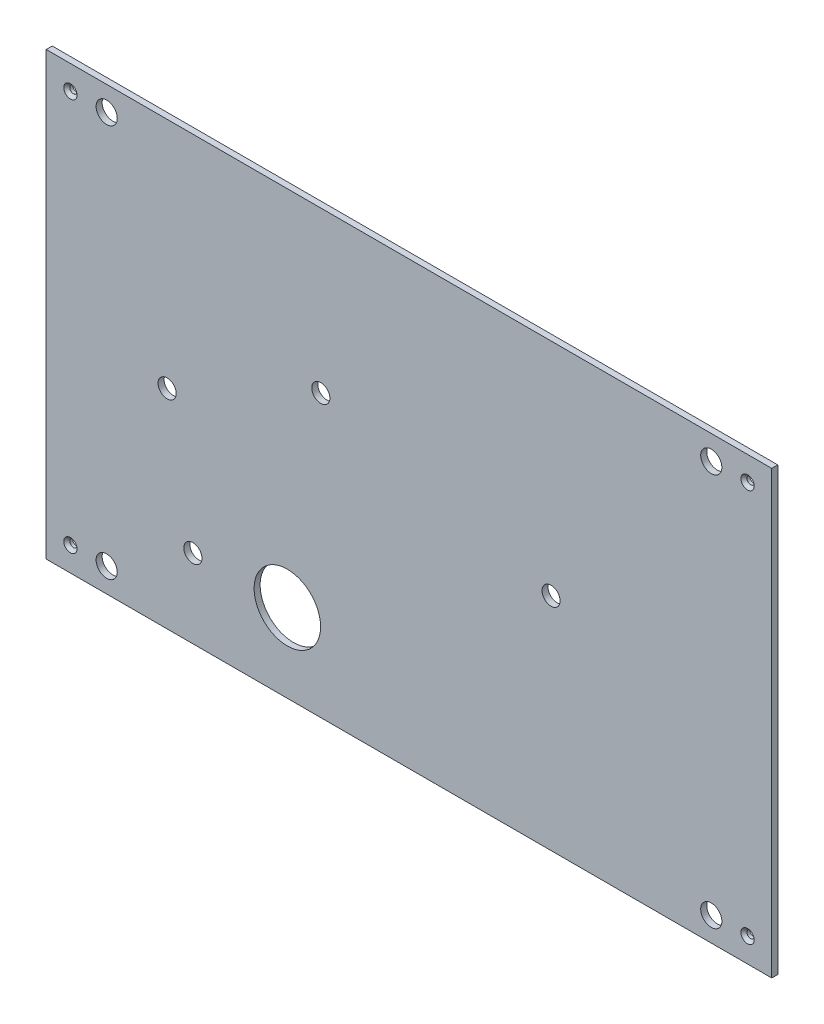
ISO-10303-21;
HEADER;
FILE_DESCRIPTION(('STEP AP214'),'2;1');
FILE_NAME('part.step','',(''),(''),'','','');
FILE_SCHEMA(('AUTOMOTIVE_DESIGN { 1 0 10303 214 1 1 1 1 }'));
ENDSEC;
DATA;
#1=APPLICATION_CONTEXT('core data for automotive mechanical design processes');
#2=APPLICATION_PROTOCOL_DEFINITION('international standard','automotive_design',2000,#1);
#3=PRODUCT_CONTEXT('',#1,'mechanical');
#4=PRODUCT('Part','Part','',(#3));
#5=PRODUCT_RELATED_PRODUCT_CATEGORY('part','',(#4));
#6=PRODUCT_DEFINITION_FORMATION('','',#4);
#7=PRODUCT_DEFINITION_CONTEXT('part definition',#1,'design');
#8=PRODUCT_DEFINITION('design','',#6,#7);
#9=PRODUCT_DEFINITION_SHAPE('','',#8);
#10=(LENGTH_UNIT() NAMED_UNIT(*) SI_UNIT(.MILLI.,.METRE.));
#11=(NAMED_UNIT(*) PLANE_ANGLE_UNIT() SI_UNIT($,.RADIAN.));
#12=(NAMED_UNIT(*) SI_UNIT($,.STERADIAN.) SOLID_ANGLE_UNIT());
#13=UNCERTAINTY_MEASURE_WITH_UNIT(LENGTH_MEASURE(1.E-05),#10,'distance_accuracy_value','');
#14=(GEOMETRIC_REPRESENTATION_CONTEXT(3) GLOBAL_UNCERTAINTY_ASSIGNED_CONTEXT((#13)) GLOBAL_UNIT_ASSIGNED_CONTEXT((#10,
#11,#12)) REPRESENTATION_CONTEXT('',''));
#15=CARTESIAN_POINT('',(0.,0.,0.));
#16=DIRECTION('',(0.,0.,1.));
#17=DIRECTION('',(1.,0.,0.));
#18=AXIS2_PLACEMENT_3D('',#15,#16,#17);
#19=CARTESIAN_POINT('',(0.,0.,2.));
#20=DIRECTION('',(0.,1.,0.));
#21=DIRECTION('',(0.,0.,1.));
#22=AXIS2_PLACEMENT_3D('',#19,#20,#21);
#23=PLANE('',#22);
#24=DIRECTION('',(1.,0.,0.));
#25=VECTOR('',#24,1.);
#26=CARTESIAN_POINT('',(0.,0.,0.));
#27=LINE('',#26,#25);
#28=CARTESIAN_POINT('',(0.,0.,0.));
#29=VERTEX_POINT('',#28);
#30=CARTESIAN_POINT('',(240.,0.,0.));
#31=VERTEX_POINT('',#30);
#32=EDGE_CURVE('E150',#29,#31,#27,.T.);
#33=ORIENTED_EDGE('',*,*,#32,.T.);
#34=DIRECTION('',(0.,0.,-1.));
#35=VECTOR('',#34,1.);
#36=CARTESIAN_POINT('',(240.,0.,2.));
#37=LINE('',#36,#35);
#38=CARTESIAN_POINT('',(240.,0.,2.));
#39=VERTEX_POINT('',#38);
#40=EDGE_CURVE('E11',#39,#31,#37,.T.);
#41=ORIENTED_EDGE('',*,*,#40,.F.);
#42=DIRECTION('',(1.,0.,0.));
#43=VECTOR('',#42,1.);
#44=CARTESIAN_POINT('',(0.,0.,2.));
#45=LINE('',#44,#43);
#46=CARTESIAN_POINT('',(0.,0.,2.));
#47=VERTEX_POINT('',#46);
#48=EDGE_CURVE('E95',#47,#39,#45,.T.);
#49=ORIENTED_EDGE('',*,*,#48,.F.);
#50=DIRECTION('',(0.,0.,-1.));
#51=VECTOR('',#50,1.);
#52=CARTESIAN_POINT('',(0.,0.,2.));
#53=LINE('',#52,#51);
#54=EDGE_CURVE('E61',#47,#29,#53,.T.);
#55=ORIENTED_EDGE('',*,*,#54,.T.);
#56=EDGE_LOOP('',(#33,#41,#49,#55));
#57=FACE_BOUND('',#56,.T.);
#58=ADVANCED_FACE('F43',(#57),#23,.F.);
#59=CARTESIAN_POINT('',(240.,0.,2.));
#60=DIRECTION('',(-1.,0.,0.));
#61=DIRECTION('',(0.,0.,1.));
#62=AXIS2_PLACEMENT_3D('',#59,#60,#61);
#63=PLANE('',#62);
#64=DIRECTION('',(0.,1.,0.));
#65=VECTOR('',#64,1.);
#66=CARTESIAN_POINT('',(240.,0.,0.));
#67=LINE('',#66,#65);
#68=CARTESIAN_POINT('',(240.,146.,0.));
#69=VERTEX_POINT('',#68);
#70=EDGE_CURVE('E101',#31,#69,#67,.T.);
#71=ORIENTED_EDGE('',*,*,#70,.T.);
#72=DIRECTION('',(0.,0.,-1.));
#73=VECTOR('',#72,1.);
#74=CARTESIAN_POINT('',(240.,146.,2.));
#75=LINE('',#74,#73);
#76=CARTESIAN_POINT('',(240.,146.,2.));
#77=VERTEX_POINT('',#76);
#78=EDGE_CURVE('E53',#77,#69,#75,.T.);
#79=ORIENTED_EDGE('',*,*,#78,.F.);
#80=DIRECTION('',(0.,1.,0.));
#81=VECTOR('',#80,1.);
#82=CARTESIAN_POINT('',(240.,0.,2.));
#83=LINE('',#82,#81);
#84=EDGE_CURVE('E86',#39,#77,#83,.T.);
#85=ORIENTED_EDGE('',*,*,#84,.F.);
#86=ORIENTED_EDGE('',*,*,#40,.T.);
#87=EDGE_LOOP('',(#71,#79,#85,#86));
#88=FACE_BOUND('',#87,.T.);
#89=ADVANCED_FACE('F100',(#88),#63,.F.);
#90=CARTESIAN_POINT('',(0.,146.,2.));
#91=DIRECTION('',(0.,1.,0.));
#92=DIRECTION('',(0.,0.,1.));
#93=AXIS2_PLACEMENT_3D('',#90,#91,#92);
#94=PLANE('',#93);
#95=DIRECTION('',(1.,0.,0.));
#96=VECTOR('',#95,1.);
#97=CARTESIAN_POINT('',(0.,146.,0.));
#98=LINE('',#97,#96);
#99=CARTESIAN_POINT('',(0.,146.,0.));
#100=VERTEX_POINT('',#99);
#101=EDGE_CURVE('E155',#100,#69,#98,.T.);
#102=ORIENTED_EDGE('',*,*,#101,.F.);
#103=DIRECTION('',(0.,0.,-1.));
#104=VECTOR('',#103,1.);
#105=CARTESIAN_POINT('',(0.,146.,2.));
#106=LINE('',#105,#104);
#107=CARTESIAN_POINT('',(0.,146.,2.));
#108=VERTEX_POINT('',#107);
#109=EDGE_CURVE('E75',#108,#100,#106,.T.);
#110=ORIENTED_EDGE('',*,*,#109,.F.);
#111=DIRECTION('',(1.,0.,0.));
#112=VECTOR('',#111,1.);
#113=CARTESIAN_POINT('',(0.,146.,2.));
#114=LINE('',#113,#112);
#115=EDGE_CURVE('E94',#108,#77,#114,.T.);
#116=ORIENTED_EDGE('',*,*,#115,.T.);
#117=ORIENTED_EDGE('',*,*,#78,.T.);
#118=EDGE_LOOP('',(#102,#110,#116,#117));
#119=FACE_BOUND('',#118,.T.);
#120=ADVANCED_FACE('F105',(#119),#94,.T.);
#121=CARTESIAN_POINT('',(220.,8.00000000000001,2.));
#122=DIRECTION('',(0.,0.,-1.));
#123=DIRECTION('',(-1.,0.,0.));
#124=AXIS2_PLACEMENT_3D('',#121,#122,#123);
#125=CYLINDRICAL_SURFACE('',#124,3.49999999999999);
#126=CARTESIAN_POINT('',(220.,8.00000000000001,2.));
#127=DIRECTION('',(0.,0.,1.));
#128=DIRECTION('',(1.,0.,0.));
#129=AXIS2_PLACEMENT_3D('',#126,#127,#128);
#130=CIRCLE('',#129,3.49999999999999);
#131=CARTESIAN_POINT('',(223.5,8.00000000000001,2.));
#132=VERTEX_POINT('',#131);
#133=EDGE_CURVE('E110',#132,#132,#130,.T.);
#134=ORIENTED_EDGE('',*,*,#133,.T.);
#135=EDGE_LOOP('',(#134));
#136=FACE_BOUND('',#135,.T.);
#137=CARTESIAN_POINT('',(220.,8.00000000000001,0.));
#138=DIRECTION('',(0.,0.,1.));
#139=DIRECTION('',(1.,0.,0.));
#140=AXIS2_PLACEMENT_3D('',#137,#138,#139);
#141=CIRCLE('',#140,3.49999999999999);
#142=CARTESIAN_POINT('',(223.5,8.00000000000001,0.));
#143=VERTEX_POINT('',#142);
#144=EDGE_CURVE('E162',#143,#143,#141,.T.);
#145=ORIENTED_EDGE('',*,*,#144,.F.);
#146=EDGE_LOOP('',(#145));
#147=FACE_BOUND('',#146,.T.);
#148=ADVANCED_FACE('F282',(#136,#147),#125,.F.);
#149=CARTESIAN_POINT('',(0.,0.,2.));
#150=DIRECTION('',(-1.,0.,0.));
#151=DIRECTION('',(0.,0.,1.));
#152=AXIS2_PLACEMENT_3D('',#149,#150,#151);
#153=PLANE('',#152);
#154=DIRECTION('',(0.,1.,0.));
#155=VECTOR('',#154,1.);
#156=CARTESIAN_POINT('',(0.,0.,0.));
#157=LINE('',#156,#155);
#158=EDGE_CURVE('E158',#29,#100,#157,.T.);
#159=ORIENTED_EDGE('',*,*,#158,.F.);
#160=ORIENTED_EDGE('',*,*,#54,.F.);
#161=DIRECTION('',(0.,1.,0.));
#162=VECTOR('',#161,1.);
#163=CARTESIAN_POINT('',(0.,0.,2.));
#164=LINE('',#163,#162);
#165=EDGE_CURVE('E107',#47,#108,#164,.T.);
#166=ORIENTED_EDGE('',*,*,#165,.T.);
#167=ORIENTED_EDGE('',*,*,#109,.T.);
#168=EDGE_LOOP('',(#159,#160,#166,#167));
#169=FACE_BOUND('',#168,.T.);
#170=ADVANCED_FACE('F241',(#169),#153,.T.);
#171=CARTESIAN_POINT('',(79.7653507489251,26.,2.));
#172=DIRECTION('',(0.,0.,-1.));
#173=DIRECTION('',(-1.,0.,0.));
#174=AXIS2_PLACEMENT_3D('',#171,#172,#173);
#175=CYLINDRICAL_SURFACE('',#174,11.);
#176=CARTESIAN_POINT('',(79.7653507489251,26.,2.));
#177=DIRECTION('',(0.,0.,1.));
#178=DIRECTION('',(1.,0.,0.));
#179=AXIS2_PLACEMENT_3D('',#176,#177,#178);
#180=CIRCLE('',#179,11.);
#181=CARTESIAN_POINT('',(90.7653507489251,26.,2.));
#182=VERTEX_POINT('',#181);
#183=EDGE_CURVE('E204',#182,#182,#180,.T.);
#184=ORIENTED_EDGE('',*,*,#183,.T.);
#185=EDGE_LOOP('',(#184));
#186=FACE_BOUND('',#185,.T.);
#187=CARTESIAN_POINT('',(79.7653507489251,26.,0.));
#188=DIRECTION('',(0.,0.,1.));
#189=DIRECTION('',(1.,0.,0.));
#190=AXIS2_PLACEMENT_3D('',#187,#188,#189);
#191=CIRCLE('',#190,11.);
#192=CARTESIAN_POINT('',(90.7653507489251,26.,0.));
#193=VERTEX_POINT('',#192);
#194=EDGE_CURVE('E146',#193,#193,#191,.T.);
#195=ORIENTED_EDGE('',*,*,#194,.F.);
#196=EDGE_LOOP('',(#195));
#197=FACE_BOUND('',#196,.T.);
#198=ADVANCED_FACE('F210',(#186,#197),#175,.F.);
#199=CARTESIAN_POINT('',(48.5153507489251,26.,2.));
#200=DIRECTION('',(0.,0.,-1.));
#201=DIRECTION('',(-1.,0.,0.));
#202=AXIS2_PLACEMENT_3D('',#199,#200,#201);
#203=CYLINDRICAL_SURFACE('',#202,3.);
#204=CARTESIAN_POINT('',(48.5153507489251,26.,2.));
#205=DIRECTION('',(0.,0.,1.));
#206=DIRECTION('',(1.,0.,0.));
#207=AXIS2_PLACEMENT_3D('',#204,#205,#206);
#208=CIRCLE('',#207,3.);
#209=CARTESIAN_POINT('',(51.5153507489251,26.,2.));
#210=VERTEX_POINT('',#209);
#211=EDGE_CURVE('E200',#210,#210,#208,.T.);
#212=ORIENTED_EDGE('',*,*,#211,.T.);
#213=EDGE_LOOP('',(#212));
#214=FACE_BOUND('',#213,.T.);
#215=CARTESIAN_POINT('',(48.5153507489251,26.,0.));
#216=DIRECTION('',(0.,0.,1.));
#217=DIRECTION('',(1.,0.,0.));
#218=AXIS2_PLACEMENT_3D('',#215,#216,#217);
#219=CIRCLE('',#218,3.);
#220=CARTESIAN_POINT('',(51.5153507489251,26.,0.));
#221=VERTEX_POINT('',#220);
#222=EDGE_CURVE('E142',#221,#221,#219,.T.);
#223=ORIENTED_EDGE('',*,*,#222,.F.);
#224=EDGE_LOOP('',(#223));
#225=FACE_BOUND('',#224,.T.);
#226=ADVANCED_FACE('F240',(#214,#225),#203,.F.);
#227=CARTESIAN_POINT('',(167.,73.,2.));
#228=DIRECTION('',(0.,0.,-1.));
#229=DIRECTION('',(-1.,0.,0.));
#230=AXIS2_PLACEMENT_3D('',#227,#228,#229);
#231=CYLINDRICAL_SURFACE('',#230,2.99999999999999);
#232=CARTESIAN_POINT('',(167.,73.,2.));
#233=DIRECTION('',(0.,0.,1.));
#234=DIRECTION('',(1.,0.,0.));
#235=AXIS2_PLACEMENT_3D('',#232,#233,#234);
#236=CIRCLE('',#235,2.99999999999999);
#237=CARTESIAN_POINT('',(170.,73.,2.));
#238=VERTEX_POINT('',#237);
#239=EDGE_CURVE('E196',#238,#238,#236,.T.);
#240=ORIENTED_EDGE('',*,*,#239,.T.);
#241=EDGE_LOOP('',(#240));
#242=FACE_BOUND('',#241,.T.);
#243=CARTESIAN_POINT('',(167.,73.,0.));
#244=DIRECTION('',(0.,0.,1.));
#245=DIRECTION('',(1.,0.,0.));
#246=AXIS2_PLACEMENT_3D('',#243,#244,#245);
#247=CIRCLE('',#246,2.99999999999999);
#248=CARTESIAN_POINT('',(170.,73.,0.));
#249=VERTEX_POINT('',#248);
#250=EDGE_CURVE('E138',#249,#249,#247,.T.);
#251=ORIENTED_EDGE('',*,*,#250,.F.);
#252=EDGE_LOOP('',(#251));
#253=FACE_BOUND('',#252,.T.);
#254=ADVANCED_FACE('F244',(#242,#253),#231,.F.);
#255=CARTESIAN_POINT('',(90.8320113170894,93.,2.));
#256=DIRECTION('',(0.,0.,-1.));
#257=DIRECTION('',(-1.,0.,0.));
#258=AXIS2_PLACEMENT_3D('',#255,#256,#257);
#259=CYLINDRICAL_SURFACE('',#258,3.00000000000001);
#260=CARTESIAN_POINT('',(90.8320113170894,93.,2.));
#261=DIRECTION('',(0.,0.,1.));
#262=DIRECTION('',(1.,0.,0.));
#263=AXIS2_PLACEMENT_3D('',#260,#261,#262);
#264=CIRCLE('',#263,3.00000000000001);
#265=CARTESIAN_POINT('',(93.8320113170894,93.,2.));
#266=VERTEX_POINT('',#265);
#267=EDGE_CURVE('E192',#266,#266,#264,.T.);
#268=ORIENTED_EDGE('',*,*,#267,.T.);
#269=EDGE_LOOP('',(#268));
#270=FACE_BOUND('',#269,.T.);
#271=CARTESIAN_POINT('',(90.8320113170894,93.,0.));
#272=DIRECTION('',(0.,0.,1.));
#273=DIRECTION('',(1.,0.,0.));
#274=AXIS2_PLACEMENT_3D('',#271,#272,#273);
#275=CIRCLE('',#274,3.00000000000001);
#276=CARTESIAN_POINT('',(93.8320113170894,93.,0.));
#277=VERTEX_POINT('',#276);
#278=EDGE_CURVE('E134',#277,#277,#275,.T.);
#279=ORIENTED_EDGE('',*,*,#278,.F.);
#280=EDGE_LOOP('',(#279));
#281=FACE_BOUND('',#280,.T.);
#282=ADVANCED_FACE('F248',(#270,#281),#259,.F.);
#283=CARTESIAN_POINT('',(40.,68.9132998221155,2.));
#284=DIRECTION('',(0.,0.,-1.));
#285=DIRECTION('',(-1.,0.,0.));
#286=AXIS2_PLACEMENT_3D('',#283,#284,#285);
#287=CYLINDRICAL_SURFACE('',#286,3.);
#288=CARTESIAN_POINT('',(40.,68.9132998221155,2.));
#289=DIRECTION('',(0.,0.,1.));
#290=DIRECTION('',(1.,0.,0.));
#291=AXIS2_PLACEMENT_3D('',#288,#289,#290);
#292=CIRCLE('',#291,3.);
#293=CARTESIAN_POINT('',(43.,68.9132998221155,2.));
#294=VERTEX_POINT('',#293);
#295=EDGE_CURVE('E184',#294,#294,#292,.T.);
#296=ORIENTED_EDGE('',*,*,#295,.T.);
#297=EDGE_LOOP('',(#296));
#298=FACE_BOUND('',#297,.T.);
#299=CARTESIAN_POINT('',(40.,68.9132998221155,0.));
#300=DIRECTION('',(0.,0.,1.));
#301=DIRECTION('',(1.,0.,0.));
#302=AXIS2_PLACEMENT_3D('',#299,#300,#301);
#303=CIRCLE('',#302,3.);
#304=CARTESIAN_POINT('',(43.,68.9132998221155,0.));
#305=VERTEX_POINT('',#304);
#306=EDGE_CURVE('E130',#305,#305,#303,.T.);
#307=ORIENTED_EDGE('',*,*,#306,.F.);
#308=EDGE_LOOP('',(#307));
#309=FACE_BOUND('',#308,.T.);
#310=ADVANCED_FACE('F252',(#298,#309),#287,.F.);
#311=CARTESIAN_POINT('',(20.,138.,2.));
#312=DIRECTION('',(0.,0.,-1.));
#313=DIRECTION('',(-1.,0.,0.));
#314=AXIS2_PLACEMENT_3D('',#311,#312,#313);
#315=CYLINDRICAL_SURFACE('',#314,3.5);
#316=CARTESIAN_POINT('',(20.,138.,2.));
#317=DIRECTION('',(0.,0.,1.));
#318=DIRECTION('',(1.,0.,0.));
#319=AXIS2_PLACEMENT_3D('',#316,#317,#318);
#320=CIRCLE('',#319,3.5);
#321=CARTESIAN_POINT('',(23.5,138.,2.));
#322=VERTEX_POINT('',#321);
#323=EDGE_CURVE('E178',#322,#322,#320,.T.);
#324=ORIENTED_EDGE('',*,*,#323,.T.);
#325=EDGE_LOOP('',(#324));
#326=FACE_BOUND('',#325,.T.);
#327=CARTESIAN_POINT('',(20.,138.,0.));
#328=DIRECTION('',(0.,0.,1.));
#329=DIRECTION('',(1.,0.,0.));
#330=AXIS2_PLACEMENT_3D('',#327,#328,#329);
#331=CIRCLE('',#330,3.5);
#332=CARTESIAN_POINT('',(23.5,138.,0.));
#333=VERTEX_POINT('',#332);
#334=EDGE_CURVE('E125',#333,#333,#331,.T.);
#335=ORIENTED_EDGE('',*,*,#334,.F.);
#336=EDGE_LOOP('',(#335));
#337=FACE_BOUND('',#336,.T.);
#338=ADVANCED_FACE('F255',(#326,#337),#315,.F.);
#339=CARTESIAN_POINT('',(220.,138.,2.));
#340=DIRECTION('',(0.,0.,-1.));
#341=DIRECTION('',(-1.,0.,0.));
#342=AXIS2_PLACEMENT_3D('',#339,#340,#341);
#343=CYLINDRICAL_SURFACE('',#342,3.49999999999999);
#344=CARTESIAN_POINT('',(220.,138.,2.));
#345=DIRECTION('',(0.,0.,1.));
#346=DIRECTION('',(1.,0.,0.));
#347=AXIS2_PLACEMENT_3D('',#344,#345,#346);
#348=CIRCLE('',#347,3.49999999999999);
#349=CARTESIAN_POINT('',(223.5,138.,2.));
#350=VERTEX_POINT('',#349);
#351=EDGE_CURVE('E170',#350,#350,#348,.F.);
#352=ORIENTED_EDGE('',*,*,#351,.F.);
#353=EDGE_LOOP('',(#352));
#354=FACE_BOUND('',#353,.T.);
#355=CARTESIAN_POINT('',(220.,138.,0.));
#356=DIRECTION('',(0.,0.,1.));
#357=DIRECTION('',(1.,0.,0.));
#358=AXIS2_PLACEMENT_3D('',#355,#356,#357);
#359=CIRCLE('',#358,3.49999999999999);
#360=CARTESIAN_POINT('',(223.5,138.,0.));
#361=VERTEX_POINT('',#360);
#362=EDGE_CURVE('E121',#361,#361,#359,.F.);
#363=ORIENTED_EDGE('',*,*,#362,.T.);
#364=EDGE_LOOP('',(#363));
#365=FACE_BOUND('',#364,.T.);
#366=ADVANCED_FACE('F45',(#354,#365),#343,.F.);
#367=CARTESIAN_POINT('',(20.,8.00000000000001,2.));
#368=DIRECTION('',(0.,0.,-1.));
#369=DIRECTION('',(-1.,0.,0.));
#370=AXIS2_PLACEMENT_3D('',#367,#368,#369);
#371=CYLINDRICAL_SURFACE('',#370,3.5);
#372=CARTESIAN_POINT('',(20.,8.00000000000001,2.));
#373=DIRECTION('',(0.,0.,1.));
#374=DIRECTION('',(1.,0.,0.));
#375=AXIS2_PLACEMENT_3D('',#372,#373,#374);
#376=CIRCLE('',#375,3.5);
#377=CARTESIAN_POINT('',(23.5,8.00000000000001,2.));
#378=VERTEX_POINT('',#377);
#379=EDGE_CURVE('E117',#378,#378,#376,.F.);
#380=ORIENTED_EDGE('',*,*,#379,.F.);
#381=EDGE_LOOP('',(#380));
#382=FACE_BOUND('',#381,.T.);
#383=CARTESIAN_POINT('',(20.,8.00000000000001,0.));
#384=DIRECTION('',(0.,0.,1.));
#385=DIRECTION('',(1.,0.,0.));
#386=AXIS2_PLACEMENT_3D('',#383,#384,#385);
#387=CIRCLE('',#386,3.5);
#388=CARTESIAN_POINT('',(23.5,8.00000000000001,0.));
#389=VERTEX_POINT('',#388);
#390=EDGE_CURVE('E166',#389,#389,#387,.F.);
#391=ORIENTED_EDGE('',*,*,#390,.T.);
#392=EDGE_LOOP('',(#391));
#393=FACE_BOUND('',#392,.T.);
#394=ADVANCED_FACE('F215',(#382,#393),#371,.F.);
#395=CARTESIAN_POINT('',(0.,0.,2.));
#396=DIRECTION('',(0.,0.,1.));
#397=DIRECTION('',(1.,0.,0.));
#398=AXIS2_PLACEMENT_3D('',#395,#396,#397);
#399=PLANE('',#398);
#400=CARTESIAN_POINT('',(8.,138.,2.));
#401=DIRECTION('',(0.,0.,1.));
#402=DIRECTION('',(1.,0.,0.));
#403=AXIS2_PLACEMENT_3D('',#400,#401,#402);
#404=CIRCLE('',#403,2.2);
#405=CARTESIAN_POINT('',(10.2,138.,2.));
#406=VERTEX_POINT('',#405);
#407=EDGE_CURVE('E457',#406,#406,#404,.T.);
#408=ORIENTED_EDGE('',*,*,#407,.F.);
#409=EDGE_LOOP('',(#408));
#410=FACE_BOUND('',#409,.T.);
#411=CARTESIAN_POINT('',(232.,138.,2.));
#412=DIRECTION('',(0.,0.,1.));
#413=DIRECTION('',(1.,0.,0.));
#414=AXIS2_PLACEMENT_3D('',#411,#412,#413);
#415=CIRCLE('',#414,2.20000000000001);
#416=CARTESIAN_POINT('',(234.2,138.,2.));
#417=VERTEX_POINT('',#416);
#418=EDGE_CURVE('E467',#417,#417,#415,.T.);
#419=ORIENTED_EDGE('',*,*,#418,.F.);
#420=EDGE_LOOP('',(#419));
#421=FACE_BOUND('',#420,.T.);
#422=CARTESIAN_POINT('',(232.,8.00000000000001,2.));
#423=DIRECTION('',(0.,0.,1.));
#424=DIRECTION('',(1.,0.,0.));
#425=AXIS2_PLACEMENT_3D('',#422,#423,#424);
#426=CIRCLE('',#425,2.20000000000001);
#427=CARTESIAN_POINT('',(234.2,8.00000000000001,2.));
#428=VERTEX_POINT('',#427);
#429=EDGE_CURVE('E479',#428,#428,#426,.T.);
#430=ORIENTED_EDGE('',*,*,#429,.F.);
#431=EDGE_LOOP('',(#430));
#432=FACE_BOUND('',#431,.T.);
#433=CARTESIAN_POINT('',(8.,8.00000000000001,2.));
#434=DIRECTION('',(0.,0.,1.));
#435=DIRECTION('',(1.,0.,0.));
#436=AXIS2_PLACEMENT_3D('',#433,#434,#435);
#437=CIRCLE('',#436,2.2);
#438=CARTESIAN_POINT('',(10.2,8.00000000000001,2.));
#439=VERTEX_POINT('',#438);
#440=EDGE_CURVE('E491',#439,#439,#437,.T.);
#441=ORIENTED_EDGE('',*,*,#440,.F.);
#442=EDGE_LOOP('',(#441));
#443=FACE_BOUND('',#442,.T.);
#444=ORIENTED_EDGE('',*,*,#351,.T.);
#445=EDGE_LOOP('',(#444));
#446=FACE_BOUND('',#445,.T.);
#447=ORIENTED_EDGE('',*,*,#323,.F.);
#448=EDGE_LOOP('',(#447));
#449=FACE_BOUND('',#448,.T.);
#450=ORIENTED_EDGE('',*,*,#295,.F.);
#451=EDGE_LOOP('',(#450));
#452=FACE_BOUND('',#451,.T.);
#453=ORIENTED_EDGE('',*,*,#267,.F.);
#454=EDGE_LOOP('',(#453));
#455=FACE_BOUND('',#454,.T.);
#456=ORIENTED_EDGE('',*,*,#239,.F.);
#457=EDGE_LOOP('',(#456));
#458=FACE_BOUND('',#457,.T.);
#459=ORIENTED_EDGE('',*,*,#211,.F.);
#460=EDGE_LOOP('',(#459));
#461=FACE_BOUND('',#460,.T.);
#462=ORIENTED_EDGE('',*,*,#183,.F.);
#463=EDGE_LOOP('',(#462));
#464=FACE_BOUND('',#463,.T.);
#465=ORIENTED_EDGE('',*,*,#48,.T.);
#466=ORIENTED_EDGE('',*,*,#84,.T.);
#467=ORIENTED_EDGE('',*,*,#115,.F.);
#468=ORIENTED_EDGE('',*,*,#165,.F.);
#469=EDGE_LOOP('',(#465,#466,#467,#468));
#470=FACE_BOUND('',#469,.T.);
#471=ORIENTED_EDGE('',*,*,#133,.F.);
#472=EDGE_LOOP('',(#471));
#473=FACE_BOUND('',#472,.T.);
#474=ORIENTED_EDGE('',*,*,#379,.T.);
#475=EDGE_LOOP('',(#474));
#476=FACE_BOUND('',#475,.T.);
#477=ADVANCED_FACE('F90',(#410,#421,#432,#443,#446,#449,#452,#455,#458,#461,#464,#470,#473,
#476),#399,.T.);
#478=CARTESIAN_POINT('',(0.,0.,0.));
#479=DIRECTION('',(0.,0.,1.));
#480=DIRECTION('',(1.,0.,0.));
#481=AXIS2_PLACEMENT_3D('',#478,#479,#480);
#482=PLANE('',#481);
#483=CARTESIAN_POINT('',(8.,138.,0.));
#484=DIRECTION('',(0.,0.,1.));
#485=DIRECTION('',(1.,0.,0.));
#486=AXIS2_PLACEMENT_3D('',#483,#484,#485);
#487=CIRCLE('',#486,1.19999999999999);
#488=CARTESIAN_POINT('',(9.19999999999999,138.,0.));
#489=VERTEX_POINT('',#488);
#490=EDGE_CURVE('E461',#489,#489,#487,.T.);
#491=ORIENTED_EDGE('',*,*,#490,.T.);
#492=EDGE_LOOP('',(#491));
#493=FACE_BOUND('',#492,.T.);
#494=CARTESIAN_POINT('',(232.,138.,0.));
#495=DIRECTION('',(0.,0.,1.));
#496=DIRECTION('',(1.,0.,0.));
#497=AXIS2_PLACEMENT_3D('',#494,#495,#496);
#498=CIRCLE('',#497,1.19999999999998);
#499=CARTESIAN_POINT('',(233.2,138.,0.));
#500=VERTEX_POINT('',#499);
#501=EDGE_CURVE('E475',#500,#500,#498,.T.);
#502=ORIENTED_EDGE('',*,*,#501,.T.);
#503=EDGE_LOOP('',(#502));
#504=FACE_BOUND('',#503,.T.);
#505=CARTESIAN_POINT('',(232.,8.00000000000001,0.));
#506=DIRECTION('',(0.,0.,1.));
#507=DIRECTION('',(1.,0.,0.));
#508=AXIS2_PLACEMENT_3D('',#505,#506,#507);
#509=CIRCLE('',#508,1.19999999999998);
#510=CARTESIAN_POINT('',(233.2,8.00000000000001,0.));
#511=VERTEX_POINT('',#510);
#512=EDGE_CURVE('E487',#511,#511,#509,.T.);
#513=ORIENTED_EDGE('',*,*,#512,.T.);
#514=EDGE_LOOP('',(#513));
#515=FACE_BOUND('',#514,.T.);
#516=CARTESIAN_POINT('',(8.,8.00000000000001,0.));
#517=DIRECTION('',(0.,0.,1.));
#518=DIRECTION('',(1.,0.,0.));
#519=AXIS2_PLACEMENT_3D('',#516,#517,#518);
#520=CIRCLE('',#519,1.19999999999999);
#521=CARTESIAN_POINT('',(9.19999999999999,8.00000000000001,0.));
#522=VERTEX_POINT('',#521);
#523=EDGE_CURVE('E126',#522,#522,#520,.T.);
#524=ORIENTED_EDGE('',*,*,#523,.T.);
#525=EDGE_LOOP('',(#524));
#526=FACE_BOUND('',#525,.T.);
#527=ORIENTED_EDGE('',*,*,#362,.F.);
#528=EDGE_LOOP('',(#527));
#529=FACE_BOUND('',#528,.T.);
#530=ORIENTED_EDGE('',*,*,#334,.T.);
#531=EDGE_LOOP('',(#530));
#532=FACE_BOUND('',#531,.T.);
#533=ORIENTED_EDGE('',*,*,#306,.T.);
#534=EDGE_LOOP('',(#533));
#535=FACE_BOUND('',#534,.T.);
#536=ORIENTED_EDGE('',*,*,#278,.T.);
#537=EDGE_LOOP('',(#536));
#538=FACE_BOUND('',#537,.T.);
#539=ORIENTED_EDGE('',*,*,#250,.T.);
#540=EDGE_LOOP('',(#539));
#541=FACE_BOUND('',#540,.T.);
#542=ORIENTED_EDGE('',*,*,#222,.T.);
#543=EDGE_LOOP('',(#542));
#544=FACE_BOUND('',#543,.T.);
#545=ORIENTED_EDGE('',*,*,#194,.T.);
#546=EDGE_LOOP('',(#545));
#547=FACE_BOUND('',#546,.T.);
#548=ORIENTED_EDGE('',*,*,#32,.F.);
#549=ORIENTED_EDGE('',*,*,#158,.T.);
#550=ORIENTED_EDGE('',*,*,#101,.T.);
#551=ORIENTED_EDGE('',*,*,#70,.F.);
#552=EDGE_LOOP('',(#548,#549,#550,#551));
#553=FACE_BOUND('',#552,.T.);
#554=ORIENTED_EDGE('',*,*,#144,.T.);
#555=EDGE_LOOP('',(#554));
#556=FACE_BOUND('',#555,.T.);
#557=ORIENTED_EDGE('',*,*,#390,.F.);
#558=EDGE_LOOP('',(#557));
#559=FACE_BOUND('',#558,.T.);
#560=ADVANCED_FACE('F214',(#493,#504,#515,#526,#529,#532,#535,#538,#541,#544,#547,#553,#556,
#559),#482,.F.);
#561=CARTESIAN_POINT('',(8.,8.00000000000001,2.));
#562=DIRECTION('',(0.,0.,1.));
#563=DIRECTION('',(1.,0.,0.));
#564=AXIS2_PLACEMENT_3D('',#561,#562,#563);
#565=CYLINDRICAL_SURFACE('',#564,1.19999999999999);
#566=ORIENTED_EDGE('',*,*,#523,.F.);
#567=EDGE_LOOP('',(#566));
#568=FACE_BOUND('',#567,.T.);
#569=CARTESIAN_POINT('',(8.,8.00000000000001,0.999999999999999));
#570=DIRECTION('',(0.,0.,1.));
#571=DIRECTION('',(1.,0.,0.));
#572=AXIS2_PLACEMENT_3D('',#569,#570,#571);
#573=CIRCLE('',#572,1.19999999999999);
#574=CARTESIAN_POINT('',(9.19999999999999,8.00000000000001,0.999999999999999));
#575=VERTEX_POINT('',#574);
#576=EDGE_CURVE('E494',#575,#575,#573,.T.);
#577=ORIENTED_EDGE('',*,*,#576,.T.);
#578=EDGE_LOOP('',(#577));
#579=FACE_BOUND('',#578,.T.);
#580=ADVANCED_FACE('F222',(#568,#579),#565,.F.);
#581=CARTESIAN_POINT('',(8.,8.00000000000001,2.));
#582=DIRECTION('',(0.,0.,1.));
#583=DIRECTION('',(1.,0.,0.));
#584=AXIS2_PLACEMENT_3D('',#581,#582,#583);
#585=CONICAL_SURFACE('',#584,2.2,0.785398163397453);
#586=ORIENTED_EDGE('',*,*,#576,.F.);
#587=EDGE_LOOP('',(#586));
#588=FACE_BOUND('',#587,.T.);
#589=ORIENTED_EDGE('',*,*,#440,.T.);
#590=EDGE_LOOP('',(#589));
#591=FACE_BOUND('',#590,.T.);
#592=ADVANCED_FACE('F379',(#588,#591),#585,.F.);
#593=CARTESIAN_POINT('',(232.,8.00000000000001,2.));
#594=DIRECTION('',(0.,0.,1.));
#595=DIRECTION('',(1.,0.,0.));
#596=AXIS2_PLACEMENT_3D('',#593,#594,#595);
#597=CYLINDRICAL_SURFACE('',#596,1.19999999999998);
#598=ORIENTED_EDGE('',*,*,#512,.F.);
#599=EDGE_LOOP('',(#598));
#600=FACE_BOUND('',#599,.T.);
#601=CARTESIAN_POINT('',(232.,8.00000000000001,0.999999999999999));
#602=DIRECTION('',(0.,0.,1.));
#603=DIRECTION('',(1.,0.,0.));
#604=AXIS2_PLACEMENT_3D('',#601,#602,#603);
#605=CIRCLE('',#604,1.19999999999998);
#606=CARTESIAN_POINT('',(233.2,8.00000000000001,0.999999999999999));
#607=VERTEX_POINT('',#606);
#608=EDGE_CURVE('E483',#607,#607,#605,.T.);
#609=ORIENTED_EDGE('',*,*,#608,.T.);
#610=EDGE_LOOP('',(#609));
#611=FACE_BOUND('',#610,.T.);
#612=ADVANCED_FACE('F387',(#600,#611),#597,.F.);
#613=CARTESIAN_POINT('',(232.,8.00000000000001,2.));
#614=DIRECTION('',(0.,0.,1.));
#615=DIRECTION('',(1.,0.,0.));
#616=AXIS2_PLACEMENT_3D('',#613,#614,#615);
#617=CONICAL_SURFACE('',#616,2.20000000000001,0.785398163397461);
#618=ORIENTED_EDGE('',*,*,#608,.F.);
#619=EDGE_LOOP('',(#618));
#620=FACE_BOUND('',#619,.T.);
#621=ORIENTED_EDGE('',*,*,#429,.T.);
#622=EDGE_LOOP('',(#621));
#623=FACE_BOUND('',#622,.T.);
#624=ADVANCED_FACE('F396',(#620,#623),#617,.F.);
#625=CARTESIAN_POINT('',(232.,138.,2.));
#626=DIRECTION('',(0.,0.,1.));
#627=DIRECTION('',(1.,0.,0.));
#628=AXIS2_PLACEMENT_3D('',#625,#626,#627);
#629=CYLINDRICAL_SURFACE('',#628,1.19999999999998);
#630=ORIENTED_EDGE('',*,*,#501,.F.);
#631=EDGE_LOOP('',(#630));
#632=FACE_BOUND('',#631,.T.);
#633=CARTESIAN_POINT('',(232.,138.,0.999999999999999));
#634=DIRECTION('',(0.,0.,1.));
#635=DIRECTION('',(1.,0.,0.));
#636=AXIS2_PLACEMENT_3D('',#633,#634,#635);
#637=CIRCLE('',#636,1.19999999999998);
#638=CARTESIAN_POINT('',(233.2,138.,0.999999999999999));
#639=VERTEX_POINT('',#638);
#640=EDGE_CURVE('E471',#639,#639,#637,.T.);
#641=ORIENTED_EDGE('',*,*,#640,.T.);
#642=EDGE_LOOP('',(#641));
#643=FACE_BOUND('',#642,.T.);
#644=ADVANCED_FACE('F405',(#632,#643),#629,.F.);
#645=CARTESIAN_POINT('',(232.,138.,2.));
#646=DIRECTION('',(0.,0.,1.));
#647=DIRECTION('',(1.,0.,0.));
#648=AXIS2_PLACEMENT_3D('',#645,#646,#647);
#649=CONICAL_SURFACE('',#648,2.20000000000001,0.785398163397461);
#650=ORIENTED_EDGE('',*,*,#640,.F.);
#651=EDGE_LOOP('',(#650));
#652=FACE_BOUND('',#651,.T.);
#653=ORIENTED_EDGE('',*,*,#418,.T.);
#654=EDGE_LOOP('',(#653));
#655=FACE_BOUND('',#654,.T.);
#656=ADVANCED_FACE('F414',(#652,#655),#649,.F.);
#657=CARTESIAN_POINT('',(8.,138.,2.));
#658=DIRECTION('',(0.,0.,1.));
#659=DIRECTION('',(1.,0.,0.));
#660=AXIS2_PLACEMENT_3D('',#657,#658,#659);
#661=CYLINDRICAL_SURFACE('',#660,1.19999999999999);
#662=ORIENTED_EDGE('',*,*,#490,.F.);
#663=EDGE_LOOP('',(#662));
#664=FACE_BOUND('',#663,.T.);
#665=CARTESIAN_POINT('',(8.,138.,0.999999999999999));
#666=DIRECTION('',(0.,0.,1.));
#667=DIRECTION('',(1.,0.,0.));
#668=AXIS2_PLACEMENT_3D('',#665,#666,#667);
#669=CIRCLE('',#668,1.19999999999999);
#670=CARTESIAN_POINT('',(9.19999999999999,138.,0.999999999999999));
#671=VERTEX_POINT('',#670);
#672=EDGE_CURVE('E455',#671,#671,#669,.T.);
#673=ORIENTED_EDGE('',*,*,#672,.T.);
#674=EDGE_LOOP('',(#673));
#675=FACE_BOUND('',#674,.T.);
#676=ADVANCED_FACE('F423',(#664,#675),#661,.F.);
#677=CARTESIAN_POINT('',(8.,138.,2.));
#678=DIRECTION('',(0.,0.,1.));
#679=DIRECTION('',(1.,0.,0.));
#680=AXIS2_PLACEMENT_3D('',#677,#678,#679);
#681=CONICAL_SURFACE('',#680,2.2,0.785398163397453);
#682=ORIENTED_EDGE('',*,*,#672,.F.);
#683=EDGE_LOOP('',(#682));
#684=FACE_BOUND('',#683,.T.);
#685=ORIENTED_EDGE('',*,*,#407,.T.);
#686=EDGE_LOOP('',(#685));
#687=FACE_BOUND('',#686,.T.);
#688=ADVANCED_FACE('F432',(#684,#687),#681,.F.);
#689=CLOSED_SHELL('',(#58,#89,#120,#148,#170,#198,#226,#254,#282,#310,#338,#366,#394,#477,#560,
#580,#592,#612,#624,#644,#656,#676,#688));
#690=MANIFOLD_SOLID_BREP('B2',#689);
#691=ADVANCED_BREP_SHAPE_REPRESENTATION('',(#18,#690),#14);
#692=SHAPE_DEFINITION_REPRESENTATION(#9,#691);
ENDSEC;
END-ISO-10303-21;
